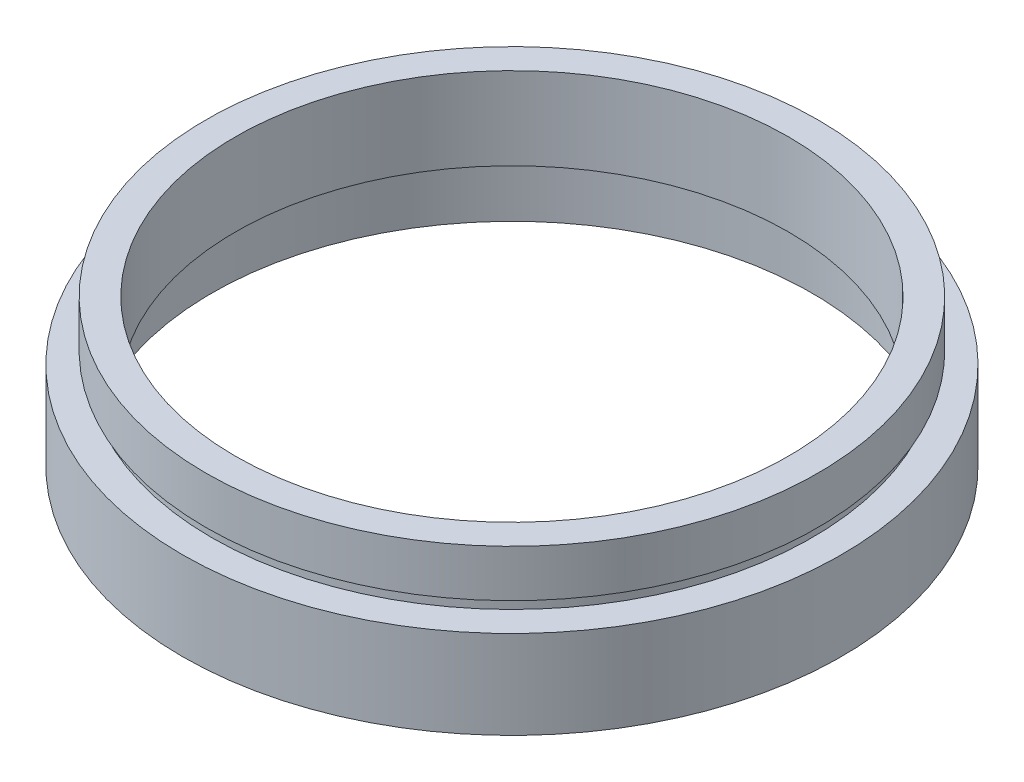
ISO-10303-21;
HEADER;
FILE_DESCRIPTION(('STEP AP214'),'2;1');
FILE_NAME('part.step','',(''),(''),'','','');
FILE_SCHEMA(('AUTOMOTIVE_DESIGN { 1 0 10303 214 1 1 1 1 }'));
ENDSEC;
DATA;
#1=APPLICATION_CONTEXT('core data for automotive mechanical design processes');
#2=APPLICATION_PROTOCOL_DEFINITION('international standard','automotive_design',2000,#1);
#3=PRODUCT_CONTEXT('',#1,'mechanical');
#4=PRODUCT('Part','Part','',(#3));
#5=PRODUCT_RELATED_PRODUCT_CATEGORY('part','',(#4));
#6=PRODUCT_DEFINITION_FORMATION('','',#4);
#7=PRODUCT_DEFINITION_CONTEXT('part definition',#1,'design');
#8=PRODUCT_DEFINITION('design','',#6,#7);
#9=PRODUCT_DEFINITION_SHAPE('','',#8);
#10=(LENGTH_UNIT() NAMED_UNIT(*) SI_UNIT(.MILLI.,.METRE.));
#11=(NAMED_UNIT(*) PLANE_ANGLE_UNIT() SI_UNIT($,.RADIAN.));
#12=(NAMED_UNIT(*) SI_UNIT($,.STERADIAN.) SOLID_ANGLE_UNIT());
#13=UNCERTAINTY_MEASURE_WITH_UNIT(LENGTH_MEASURE(1.E-05),#10,'distance_accuracy_value','');
#14=(GEOMETRIC_REPRESENTATION_CONTEXT(3) GLOBAL_UNCERTAINTY_ASSIGNED_CONTEXT((#13)) GLOBAL_UNIT_ASSIGNED_CONTEXT((#10,
#11,#12)) REPRESENTATION_CONTEXT('',''));
#15=CARTESIAN_POINT('',(0.,0.,0.));
#16=DIRECTION('',(0.,0.,1.));
#17=DIRECTION('',(1.,0.,0.));
#18=AXIS2_PLACEMENT_3D('',#15,#16,#17);
#19=CARTESIAN_POINT('',(0.,161.376166943427,0.));
#20=DIRECTION('',(0.,1.,0.));
#21=DIRECTION('',(0.,0.,1.));
#22=AXIS2_PLACEMENT_3D('',#19,#20,#21);
#23=CYLINDRICAL_SURFACE('',#22,23.5);
#24=CARTESIAN_POINT('',(0.,5.49999999999998,0.));
#25=DIRECTION('',(0.,1.,0.));
#26=DIRECTION('',(0.,0.,1.));
#27=AXIS2_PLACEMENT_3D('',#24,#25,#26);
#28=CIRCLE('',#27,23.5);
#29=CARTESIAN_POINT('',(0.,5.49999999999998,23.5));
#30=VERTEX_POINT('',#29);
#31=EDGE_CURVE('E77',#30,#30,#28,.T.);
#32=ORIENTED_EDGE('',*,*,#31,.F.);
#33=EDGE_LOOP('',(#32));
#34=FACE_BOUND('',#33,.T.);
#35=CARTESIAN_POINT('',(0.,12.5,0.));
#36=DIRECTION('',(0.,1.,0.));
#37=DIRECTION('',(0.,0.,1.));
#38=AXIS2_PLACEMENT_3D('',#35,#36,#37);
#39=CIRCLE('',#38,23.5);
#40=CARTESIAN_POINT('',(0.,12.5,23.5));
#41=VERTEX_POINT('',#40);
#42=EDGE_CURVE('E10',#41,#41,#39,.T.);
#43=ORIENTED_EDGE('',*,*,#42,.T.);
#44=EDGE_LOOP('',(#43));
#45=FACE_BOUND('',#44,.T.);
#46=ADVANCED_FACE('F37',(#34,#45),#23,.F.);
#47=CARTESIAN_POINT('',(23.5,12.5,0.));
#48=DIRECTION('',(0.,-1.,0.));
#49=DIRECTION('',(0.,0.,-1.));
#50=AXIS2_PLACEMENT_3D('',#47,#48,#49);
#51=PLANE('',#50);
#52=ORIENTED_EDGE('',*,*,#42,.F.);
#53=EDGE_LOOP('',(#52));
#54=FACE_BOUND('',#53,.T.);
#55=CARTESIAN_POINT('',(0.,12.5,0.));
#56=DIRECTION('',(0.,1.,0.));
#57=DIRECTION('',(0.,0.,1.));
#58=AXIS2_PLACEMENT_3D('',#55,#56,#57);
#59=CIRCLE('',#58,26.);
#60=CARTESIAN_POINT('',(0.,12.5,26.));
#61=VERTEX_POINT('',#60);
#62=EDGE_CURVE('E43',#61,#61,#59,.T.);
#63=ORIENTED_EDGE('',*,*,#62,.T.);
#64=EDGE_LOOP('',(#63));
#65=FACE_BOUND('',#64,.T.);
#66=ADVANCED_FACE('F84',(#54,#65),#51,.F.);
#67=CARTESIAN_POINT('',(0.,161.376166943427,0.));
#68=DIRECTION('',(0.,1.,0.));
#69=DIRECTION('',(0.,0.,1.));
#70=AXIS2_PLACEMENT_3D('',#67,#68,#69);
#71=CYLINDRICAL_SURFACE('',#70,26.);
#72=ORIENTED_EDGE('',*,*,#62,.F.);
#73=EDGE_LOOP('',(#72));
#74=FACE_BOUND('',#73,.T.);
#75=CARTESIAN_POINT('',(0.,8.49999999999998,0.));
#76=DIRECTION('',(0.,1.,0.));
#77=DIRECTION('',(0.,0.,1.));
#78=AXIS2_PLACEMENT_3D('',#75,#76,#77);
#79=CIRCLE('',#78,26.);
#80=CARTESIAN_POINT('',(0.,8.49999999999998,26.));
#81=VERTEX_POINT('',#80);
#82=EDGE_CURVE('E47',#81,#81,#79,.T.);
#83=ORIENTED_EDGE('',*,*,#82,.T.);
#84=EDGE_LOOP('',(#83));
#85=FACE_BOUND('',#84,.T.);
#86=ADVANCED_FACE('F88',(#74,#85),#71,.T.);
#87=CARTESIAN_POINT('',(26.,8.49999999999999,0.));
#88=DIRECTION('',(0.,1.,0.));
#89=DIRECTION('',(0.,0.,1.));
#90=AXIS2_PLACEMENT_3D('',#87,#88,#89);
#91=PLANE('',#90);
#92=ORIENTED_EDGE('',*,*,#82,.F.);
#93=EDGE_LOOP('',(#92));
#94=FACE_BOUND('',#93,.T.);
#95=CARTESIAN_POINT('',(0.,8.49999999999998,0.));
#96=DIRECTION('',(0.,1.,0.));
#97=DIRECTION('',(0.,0.,1.));
#98=AXIS2_PLACEMENT_3D('',#95,#96,#97);
#99=CIRCLE('',#98,25.5);
#100=CARTESIAN_POINT('',(0.,8.49999999999998,25.5));
#101=VERTEX_POINT('',#100);
#102=EDGE_CURVE('E51',#101,#101,#99,.T.);
#103=ORIENTED_EDGE('',*,*,#102,.T.);
#104=EDGE_LOOP('',(#103));
#105=FACE_BOUND('',#104,.T.);
#106=ADVANCED_FACE('F93',(#94,#105),#91,.F.);
#107=CARTESIAN_POINT('',(0.,161.376166943427,0.));
#108=DIRECTION('',(0.,1.,0.));
#109=DIRECTION('',(0.,0.,1.));
#110=AXIS2_PLACEMENT_3D('',#107,#108,#109);
#111=CYLINDRICAL_SURFACE('',#110,25.5);
#112=ORIENTED_EDGE('',*,*,#102,.F.);
#113=EDGE_LOOP('',(#112));
#114=FACE_BOUND('',#113,.T.);
#115=CARTESIAN_POINT('',(0.,7.49999999999998,0.));
#116=DIRECTION('',(0.,1.,0.));
#117=DIRECTION('',(0.,0.,1.));
#118=AXIS2_PLACEMENT_3D('',#115,#116,#117);
#119=CIRCLE('',#118,25.5);
#120=CARTESIAN_POINT('',(0.,7.49999999999998,25.5));
#121=VERTEX_POINT('',#120);
#122=EDGE_CURVE('E56',#121,#121,#119,.T.);
#123=ORIENTED_EDGE('',*,*,#122,.T.);
#124=EDGE_LOOP('',(#123));
#125=FACE_BOUND('',#124,.T.);
#126=ADVANCED_FACE('F99',(#114,#125),#111,.T.);
#127=CARTESIAN_POINT('',(25.5,7.49999999999999,0.));
#128=DIRECTION('',(0.,-1.,0.));
#129=DIRECTION('',(0.,0.,-1.));
#130=AXIS2_PLACEMENT_3D('',#127,#128,#129);
#131=PLANE('',#130);
#132=ORIENTED_EDGE('',*,*,#122,.F.);
#133=EDGE_LOOP('',(#132));
#134=FACE_BOUND('',#133,.T.);
#135=CARTESIAN_POINT('',(0.,7.49999999999998,0.));
#136=DIRECTION('',(0.,1.,0.));
#137=DIRECTION('',(0.,0.,1.));
#138=AXIS2_PLACEMENT_3D('',#135,#136,#137);
#139=CIRCLE('',#138,28.);
#140=CARTESIAN_POINT('',(0.,7.49999999999998,28.));
#141=VERTEX_POINT('',#140);
#142=EDGE_CURVE('E59',#141,#141,#139,.T.);
#143=ORIENTED_EDGE('',*,*,#142,.T.);
#144=EDGE_LOOP('',(#143));
#145=FACE_BOUND('',#144,.T.);
#146=ADVANCED_FACE('F103',(#134,#145),#131,.F.);
#147=CARTESIAN_POINT('',(0.,161.376166943427,0.));
#148=DIRECTION('',(0.,1.,0.));
#149=DIRECTION('',(0.,0.,1.));
#150=AXIS2_PLACEMENT_3D('',#147,#148,#149);
#151=CYLINDRICAL_SURFACE('',#150,28.);
#152=ORIENTED_EDGE('',*,*,#142,.F.);
#153=EDGE_LOOP('',(#152));
#154=FACE_BOUND('',#153,.T.);
#155=CARTESIAN_POINT('',(0.,0.,0.));
#156=DIRECTION('',(0.,1.,0.));
#157=DIRECTION('',(0.,0.,1.));
#158=AXIS2_PLACEMENT_3D('',#155,#156,#157);
#159=CIRCLE('',#158,28.);
#160=CARTESIAN_POINT('',(0.,0.,28.));
#161=VERTEX_POINT('',#160);
#162=EDGE_CURVE('E62',#161,#161,#159,.T.);
#163=ORIENTED_EDGE('',*,*,#162,.T.);
#164=EDGE_LOOP('',(#163));
#165=FACE_BOUND('',#164,.T.);
#166=ADVANCED_FACE('F107',(#154,#165),#151,.T.);
#167=CARTESIAN_POINT('',(28.,0.,0.));
#168=DIRECTION('',(0.,1.,0.));
#169=DIRECTION('',(0.,0.,1.));
#170=AXIS2_PLACEMENT_3D('',#167,#168,#169);
#171=PLANE('',#170);
#172=ORIENTED_EDGE('',*,*,#162,.F.);
#173=EDGE_LOOP('',(#172));
#174=FACE_BOUND('',#173,.T.);
#175=CARTESIAN_POINT('',(0.,0.,0.));
#176=DIRECTION('',(0.,1.,0.));
#177=DIRECTION('',(0.,0.,1.));
#178=AXIS2_PLACEMENT_3D('',#175,#176,#177);
#179=CIRCLE('',#178,25.5);
#180=CARTESIAN_POINT('',(0.,0.,25.5));
#181=VERTEX_POINT('',#180);
#182=EDGE_CURVE('E65',#181,#181,#179,.T.);
#183=ORIENTED_EDGE('',*,*,#182,.T.);
#184=EDGE_LOOP('',(#183));
#185=FACE_BOUND('',#184,.T.);
#186=ADVANCED_FACE('F111',(#174,#185),#171,.F.);
#187=CARTESIAN_POINT('',(0.,161.376166943427,0.));
#188=DIRECTION('',(0.,1.,0.));
#189=DIRECTION('',(0.,0.,1.));
#190=AXIS2_PLACEMENT_3D('',#187,#188,#189);
#191=CYLINDRICAL_SURFACE('',#190,25.5);
#192=ORIENTED_EDGE('',*,*,#182,.F.);
#193=EDGE_LOOP('',(#192));
#194=FACE_BOUND('',#193,.T.);
#195=CARTESIAN_POINT('',(0.,4.49999999999998,0.));
#196=DIRECTION('',(0.,1.,0.));
#197=DIRECTION('',(0.,0.,1.));
#198=AXIS2_PLACEMENT_3D('',#195,#196,#197);
#199=CIRCLE('',#198,25.5);
#200=CARTESIAN_POINT('',(0.,4.49999999999998,25.5));
#201=VERTEX_POINT('',#200);
#202=EDGE_CURVE('E68',#201,#201,#199,.T.);
#203=ORIENTED_EDGE('',*,*,#202,.T.);
#204=EDGE_LOOP('',(#203));
#205=FACE_BOUND('',#204,.T.);
#206=ADVANCED_FACE('F115',(#194,#205),#191,.F.);
#207=CARTESIAN_POINT('',(25.5,4.49999999999999,0.));
#208=DIRECTION('',(0.,-1.,0.));
#209=DIRECTION('',(0.,0.,-1.));
#210=AXIS2_PLACEMENT_3D('',#207,#208,#209);
#211=PLANE('',#210);
#212=ORIENTED_EDGE('',*,*,#202,.F.);
#213=EDGE_LOOP('',(#212));
#214=FACE_BOUND('',#213,.T.);
#215=CARTESIAN_POINT('',(0.,4.49999999999998,0.));
#216=DIRECTION('',(0.,1.,0.));
#217=DIRECTION('',(0.,0.,1.));
#218=AXIS2_PLACEMENT_3D('',#215,#216,#217);
#219=CIRCLE('',#218,26.1);
#220=CARTESIAN_POINT('',(0.,4.49999999999998,26.1));
#221=VERTEX_POINT('',#220);
#222=EDGE_CURVE('E71',#221,#221,#219,.T.);
#223=ORIENTED_EDGE('',*,*,#222,.T.);
#224=EDGE_LOOP('',(#223));
#225=FACE_BOUND('',#224,.T.);
#226=ADVANCED_FACE('F119',(#214,#225),#211,.F.);
#227=CARTESIAN_POINT('',(0.,161.376166943427,0.));
#228=DIRECTION('',(0.,1.,0.));
#229=DIRECTION('',(0.,0.,1.));
#230=AXIS2_PLACEMENT_3D('',#227,#228,#229);
#231=CYLINDRICAL_SURFACE('',#230,26.1);
#232=ORIENTED_EDGE('',*,*,#222,.F.);
#233=EDGE_LOOP('',(#232));
#234=FACE_BOUND('',#233,.T.);
#235=CARTESIAN_POINT('',(0.,5.49999999999998,0.));
#236=DIRECTION('',(0.,1.,0.));
#237=DIRECTION('',(0.,0.,1.));
#238=AXIS2_PLACEMENT_3D('',#235,#236,#237);
#239=CIRCLE('',#238,26.1);
#240=CARTESIAN_POINT('',(0.,5.49999999999998,26.1));
#241=VERTEX_POINT('',#240);
#242=EDGE_CURVE('E74',#241,#241,#239,.T.);
#243=ORIENTED_EDGE('',*,*,#242,.T.);
#244=EDGE_LOOP('',(#243));
#245=FACE_BOUND('',#244,.T.);
#246=ADVANCED_FACE('F123',(#234,#245),#231,.F.);
#247=CARTESIAN_POINT('',(26.1,5.49999999999999,0.));
#248=DIRECTION('',(0.,1.,0.));
#249=DIRECTION('',(0.,0.,1.));
#250=AXIS2_PLACEMENT_3D('',#247,#248,#249);
#251=PLANE('',#250);
#252=ORIENTED_EDGE('',*,*,#242,.F.);
#253=EDGE_LOOP('',(#252));
#254=FACE_BOUND('',#253,.T.);
#255=ORIENTED_EDGE('',*,*,#31,.T.);
#256=EDGE_LOOP('',(#255));
#257=FACE_BOUND('',#256,.T.);
#258=ADVANCED_FACE('F81',(#254,#257),#251,.F.);
#259=CLOSED_SHELL('',(#46,#66,#86,#106,#126,#146,#166,#186,#206,#226,#246,#258));
#260=MANIFOLD_SOLID_BREP('B2',#259);
#261=ADVANCED_BREP_SHAPE_REPRESENTATION('',(#18,#260),#14);
#262=SHAPE_DEFINITION_REPRESENTATION(#9,#261);
ENDSEC;
END-ISO-10303-21;
